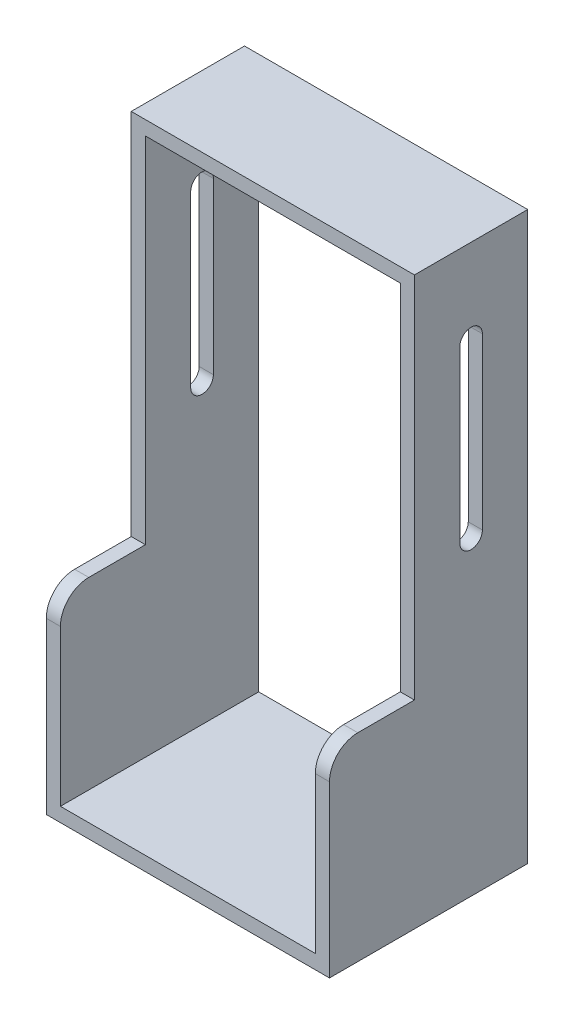
ISO-10303-21;
HEADER;
FILE_DESCRIPTION(('STEP AP214'),'2;1');
FILE_NAME('part.step','',(''),(''),'','','');
FILE_SCHEMA(('AUTOMOTIVE_DESIGN { 1 0 10303 214 1 1 1 1 }'));
ENDSEC;
DATA;
#1=APPLICATION_CONTEXT('core data for automotive mechanical design processes');
#2=APPLICATION_PROTOCOL_DEFINITION('international standard','automotive_design',2000,#1);
#3=PRODUCT_CONTEXT('',#1,'mechanical');
#4=PRODUCT('Part','Part','',(#3));
#5=PRODUCT_RELATED_PRODUCT_CATEGORY('part','',(#4));
#6=PRODUCT_DEFINITION_FORMATION('','',#4);
#7=PRODUCT_DEFINITION_CONTEXT('part definition',#1,'design');
#8=PRODUCT_DEFINITION('design','',#6,#7);
#9=PRODUCT_DEFINITION_SHAPE('','',#8);
#10=(LENGTH_UNIT() NAMED_UNIT(*) SI_UNIT(.MILLI.,.METRE.));
#11=(NAMED_UNIT(*) PLANE_ANGLE_UNIT() SI_UNIT($,.RADIAN.));
#12=(NAMED_UNIT(*) SI_UNIT($,.STERADIAN.) SOLID_ANGLE_UNIT());
#13=UNCERTAINTY_MEASURE_WITH_UNIT(LENGTH_MEASURE(1.E-05),#10,'distance_accuracy_value','');
#14=(GEOMETRIC_REPRESENTATION_CONTEXT(3) GLOBAL_UNCERTAINTY_ASSIGNED_CONTEXT((#13)) GLOBAL_UNIT_ASSIGNED_CONTEXT((#10,
#11,#12)) REPRESENTATION_CONTEXT('',''));
#15=CARTESIAN_POINT('',(0.,0.,0.));
#16=DIRECTION('',(0.,0.,1.));
#17=DIRECTION('',(1.,0.,0.));
#18=AXIS2_PLACEMENT_3D('',#15,#16,#17);
#19=CARTESIAN_POINT('',(0.,0.,70.));
#20=DIRECTION('',(0.,0.,-1.));
#21=DIRECTION('',(-1.,0.,0.));
#22=AXIS2_PLACEMENT_3D('',#19,#20,#21);
#23=PLANE('',#22);
#24=DIRECTION('',(0.,1.,0.));
#25=VECTOR('',#24,1.);
#26=CARTESIAN_POINT('',(50.,-100.,70.));
#27=LINE('',#26,#25);
#28=CARTESIAN_POINT('',(50.,-100.,70.));
#29=VERTEX_POINT('',#28);
#30=CARTESIAN_POINT('',(50.,-40.,70.));
#31=VERTEX_POINT('',#30);
#32=EDGE_CURVE('E300',#29,#31,#27,.T.);
#33=ORIENTED_EDGE('',*,*,#32,.T.);
#34=DIRECTION('',(1.,0.,0.));
#35=VECTOR('',#34,1.);
#36=CARTESIAN_POINT('',(0.,-40.,70.));
#37=LINE('',#36,#35);
#38=CARTESIAN_POINT('',(45.,-40.,70.));
#39=VERTEX_POINT('',#38);
#40=EDGE_CURVE('E337',#31,#39,#37,.F.);
#41=ORIENTED_EDGE('',*,*,#40,.T.);
#42=DIRECTION('',(0.,1.,0.));
#43=VECTOR('',#42,1.);
#44=CARTESIAN_POINT('',(45.,-95.,70.));
#45=LINE('',#44,#43);
#46=CARTESIAN_POINT('',(45.,-95.,70.));
#47=VERTEX_POINT('',#46);
#48=EDGE_CURVE('E272',#47,#39,#45,.T.);
#49=ORIENTED_EDGE('',*,*,#48,.F.);
#50=DIRECTION('',(1.,0.,0.));
#51=VECTOR('',#50,1.);
#52=CARTESIAN_POINT('',(-45.,-95.,70.));
#53=LINE('',#52,#51);
#54=CARTESIAN_POINT('',(-45.,-95.,70.));
#55=VERTEX_POINT('',#54);
#56=EDGE_CURVE('E278',#55,#47,#53,.T.);
#57=ORIENTED_EDGE('',*,*,#56,.F.);
#58=DIRECTION('',(0.,-1.,0.));
#59=VECTOR('',#58,1.);
#60=CARTESIAN_POINT('',(-45.,-95.,70.));
#61=LINE('',#60,#59);
#62=CARTESIAN_POINT('',(-45.,-40.,70.));
#63=VERTEX_POINT('',#62);
#64=EDGE_CURVE('E275',#63,#55,#61,.T.);
#65=ORIENTED_EDGE('',*,*,#64,.F.);
#66=DIRECTION('',(1.,0.,0.));
#67=VECTOR('',#66,1.);
#68=CARTESIAN_POINT('',(0.,-40.,70.));
#69=LINE('',#68,#67);
#70=CARTESIAN_POINT('',(-50.,-40.,70.));
#71=VERTEX_POINT('',#70);
#72=EDGE_CURVE('E335',#63,#71,#69,.F.);
#73=ORIENTED_EDGE('',*,*,#72,.T.);
#74=DIRECTION('',(0.,-1.,0.));
#75=VECTOR('',#74,1.);
#76=CARTESIAN_POINT('',(-50.,-100.,70.));
#77=LINE('',#76,#75);
#78=CARTESIAN_POINT('',(-50.,-100.,70.));
#79=VERTEX_POINT('',#78);
#80=EDGE_CURVE('E303',#71,#79,#77,.T.);
#81=ORIENTED_EDGE('',*,*,#80,.T.);
#82=DIRECTION('',(1.,0.,0.));
#83=VECTOR('',#82,1.);
#84=CARTESIAN_POINT('',(-50.,-100.,70.));
#85=LINE('',#84,#83);
#86=EDGE_CURVE('E306',#79,#29,#85,.T.);
#87=ORIENTED_EDGE('',*,*,#86,.T.);
#88=EDGE_LOOP('',(#33,#41,#49,#57,#65,#73,#81,#87));
#89=FACE_BOUND('',#88,.T.);
#90=ADVANCED_FACE('F37',(#89),#23,.F.);
#91=CARTESIAN_POINT('',(0.,0.,0.));
#92=DIRECTION('',(0.,0.,-1.));
#93=DIRECTION('',(-1.,0.,0.));
#94=AXIS2_PLACEMENT_3D('',#91,#92,#93);
#95=PLANE('',#94);
#96=DIRECTION('',(0.,1.,0.));
#97=VECTOR('',#96,1.);
#98=CARTESIAN_POINT('',(50.,-100.,0.));
#99=LINE('',#98,#97);
#100=CARTESIAN_POINT('',(50.,-100.,0.));
#101=VERTEX_POINT('',#100);
#102=CARTESIAN_POINT('',(50.,100.,0.));
#103=VERTEX_POINT('',#102);
#104=EDGE_CURVE('E299',#101,#103,#99,.T.);
#105=ORIENTED_EDGE('',*,*,#104,.F.);
#106=DIRECTION('',(1.,0.,0.));
#107=VECTOR('',#106,1.);
#108=CARTESIAN_POINT('',(-50.,-100.,0.));
#109=LINE('',#108,#107);
#110=CARTESIAN_POINT('',(-50.,-100.,0.));
#111=VERTEX_POINT('',#110);
#112=EDGE_CURVE('E304',#111,#101,#109,.T.);
#113=ORIENTED_EDGE('',*,*,#112,.F.);
#114=DIRECTION('',(0.,-1.,0.));
#115=VECTOR('',#114,1.);
#116=CARTESIAN_POINT('',(-50.,-100.,0.));
#117=LINE('',#116,#115);
#118=CARTESIAN_POINT('',(-50.,100.,0.));
#119=VERTEX_POINT('',#118);
#120=EDGE_CURVE('E314',#119,#111,#117,.T.);
#121=ORIENTED_EDGE('',*,*,#120,.F.);
#122=DIRECTION('',(-1.,0.,0.));
#123=VECTOR('',#122,1.);
#124=CARTESIAN_POINT('',(-50.,100.,0.));
#125=LINE('',#124,#123);
#126=EDGE_CURVE('E311',#103,#119,#125,.T.);
#127=ORIENTED_EDGE('',*,*,#126,.F.);
#128=EDGE_LOOP('',(#105,#113,#121,#127));
#129=FACE_BOUND('',#128,.T.);
#130=DIRECTION('',(1.,0.,0.));
#131=VECTOR('',#130,1.);
#132=CARTESIAN_POINT('',(-45.,-95.,0.));
#133=LINE('',#132,#131);
#134=CARTESIAN_POINT('',(-45.,-95.,0.));
#135=VERTEX_POINT('',#134);
#136=CARTESIAN_POINT('',(45.,-95.,0.));
#137=VERTEX_POINT('',#136);
#138=EDGE_CURVE('E276',#135,#137,#133,.T.);
#139=ORIENTED_EDGE('',*,*,#138,.T.);
#140=DIRECTION('',(0.,1.,0.));
#141=VECTOR('',#140,1.);
#142=CARTESIAN_POINT('',(45.,-95.,0.));
#143=LINE('',#142,#141);
#144=CARTESIAN_POINT('',(45.,95.,0.));
#145=VERTEX_POINT('',#144);
#146=EDGE_CURVE('E271',#137,#145,#143,.T.);
#147=ORIENTED_EDGE('',*,*,#146,.T.);
#148=DIRECTION('',(-1.,0.,0.));
#149=VECTOR('',#148,1.);
#150=CARTESIAN_POINT('',(-45.,95.,0.));
#151=LINE('',#150,#149);
#152=CARTESIAN_POINT('',(-45.,95.,0.));
#153=VERTEX_POINT('',#152);
#154=EDGE_CURVE('E283',#145,#153,#151,.T.);
#155=ORIENTED_EDGE('',*,*,#154,.T.);
#156=DIRECTION('',(0.,-1.,0.));
#157=VECTOR('',#156,1.);
#158=CARTESIAN_POINT('',(-45.,-95.,0.));
#159=LINE('',#158,#157);
#160=EDGE_CURVE('E286',#153,#135,#159,.T.);
#161=ORIENTED_EDGE('',*,*,#160,.T.);
#162=EDGE_LOOP('',(#139,#147,#155,#161));
#163=FACE_BOUND('',#162,.T.);
#164=ADVANCED_FACE('F424',(#129,#163),#95,.T.);
#165=CARTESIAN_POINT('',(50.,-100.,70.));
#166=DIRECTION('',(-1.,0.,0.));
#167=DIRECTION('',(0.,0.,1.));
#168=AXIS2_PLACEMENT_3D('',#165,#166,#167);
#169=PLANE('',#168);
#170=DIRECTION('',(0.,-1.,0.));
#171=VECTOR('',#170,1.);
#172=CARTESIAN_POINT('',(50.,10.,16.));
#173=LINE('',#172,#171);
#174=CARTESIAN_POINT('',(50.,70.,16.));
#175=VERTEX_POINT('',#174);
#176=CARTESIAN_POINT('',(50.,10.,16.));
#177=VERTEX_POINT('',#176);
#178=EDGE_CURVE('E210',#175,#177,#173,.T.);
#179=ORIENTED_EDGE('',*,*,#178,.T.);
#180=CARTESIAN_POINT('',(50.,10.,20.));
#181=DIRECTION('',(-1.,0.,0.));
#182=DIRECTION('',(0.,0.,1.));
#183=AXIS2_PLACEMENT_3D('',#180,#181,#182);
#184=CIRCLE('',#183,4.);
#185=CARTESIAN_POINT('',(50.,10.,24.));
#186=VERTEX_POINT('',#185);
#187=EDGE_CURVE('E192',#177,#186,#184,.T.);
#188=ORIENTED_EDGE('',*,*,#187,.T.);
#189=DIRECTION('',(0.,1.,0.));
#190=VECTOR('',#189,1.);
#191=CARTESIAN_POINT('',(50.,10.,24.));
#192=LINE('',#191,#190);
#193=CARTESIAN_POINT('',(50.,70.,24.));
#194=VERTEX_POINT('',#193);
#195=EDGE_CURVE('E202',#186,#194,#192,.T.);
#196=ORIENTED_EDGE('',*,*,#195,.T.);
#197=CARTESIAN_POINT('',(50.,70.,20.));
#198=DIRECTION('',(-1.,0.,0.));
#199=DIRECTION('',(0.,0.,1.));
#200=AXIS2_PLACEMENT_3D('',#197,#198,#199);
#201=CIRCLE('',#200,4.);
#202=EDGE_CURVE('E52',#194,#175,#201,.T.);
#203=ORIENTED_EDGE('',*,*,#202,.T.);
#204=EDGE_LOOP('',(#179,#188,#196,#203));
#205=FACE_BOUND('',#204,.T.);
#206=DIRECTION('',(0.,0.,1.));
#207=VECTOR('',#206,1.);
#208=CARTESIAN_POINT('',(50.,-30.,70.));
#209=LINE('',#208,#207);
#210=CARTESIAN_POINT('',(50.,-30.,40.));
#211=VERTEX_POINT('',#210);
#212=CARTESIAN_POINT('',(50.,-30.,60.));
#213=VERTEX_POINT('',#212);
#214=EDGE_CURVE('E261',#211,#213,#209,.T.);
#215=ORIENTED_EDGE('',*,*,#214,.T.);
#216=CARTESIAN_POINT('',(50.,-40.,60.));
#217=DIRECTION('',(-1.,0.,0.));
#218=DIRECTION('',(0.,0.,1.));
#219=AXIS2_PLACEMENT_3D('',#216,#217,#218);
#220=CIRCLE('',#219,10.);
#221=EDGE_CURVE('E333',#213,#31,#220,.F.);
#222=ORIENTED_EDGE('',*,*,#221,.T.);
#223=ORIENTED_EDGE('',*,*,#32,.F.);
#224=DIRECTION('',(0.,0.,-1.));
#225=VECTOR('',#224,1.);
#226=CARTESIAN_POINT('',(50.,-100.,70.));
#227=LINE('',#226,#225);
#228=EDGE_CURVE('E308',#29,#101,#227,.T.);
#229=ORIENTED_EDGE('',*,*,#228,.T.);
#230=ORIENTED_EDGE('',*,*,#104,.T.);
#231=DIRECTION('',(0.,0.,-1.));
#232=VECTOR('',#231,1.);
#233=CARTESIAN_POINT('',(50.,100.,70.));
#234=LINE('',#233,#232);
#235=CARTESIAN_POINT('',(50.,100.,40.));
#236=VERTEX_POINT('',#235);
#237=EDGE_CURVE('E324',#236,#103,#234,.T.);
#238=ORIENTED_EDGE('',*,*,#237,.F.);
#239=DIRECTION('',(0.,-1.,0.));
#240=VECTOR('',#239,1.);
#241=CARTESIAN_POINT('',(50.,-100.,40.));
#242=LINE('',#241,#240);
#243=EDGE_CURVE('E268',#236,#211,#242,.T.);
#244=ORIENTED_EDGE('',*,*,#243,.T.);
#245=EDGE_LOOP('',(#215,#222,#223,#229,#230,#238,#244));
#246=FACE_BOUND('',#245,.T.);
#247=ADVANCED_FACE('F207',(#205,#246),#169,.F.);
#248=CARTESIAN_POINT('',(-50.,100.,70.));
#249=DIRECTION('',(0.,-1.,0.));
#250=DIRECTION('',(0.,0.,-1.));
#251=AXIS2_PLACEMENT_3D('',#248,#249,#250);
#252=PLANE('',#251);
#253=DIRECTION('',(0.,0.,-1.));
#254=VECTOR('',#253,1.);
#255=CARTESIAN_POINT('',(-50.,100.,70.));
#256=LINE('',#255,#254);
#257=CARTESIAN_POINT('',(-50.,100.,40.));
#258=VERTEX_POINT('',#257);
#259=EDGE_CURVE('E322',#258,#119,#256,.T.);
#260=ORIENTED_EDGE('',*,*,#259,.F.);
#261=DIRECTION('',(1.,0.,0.));
#262=VECTOR('',#261,1.);
#263=CARTESIAN_POINT('',(-50.,100.,40.));
#264=LINE('',#263,#262);
#265=EDGE_CURVE('E252',#258,#236,#264,.T.);
#266=ORIENTED_EDGE('',*,*,#265,.T.);
#267=ORIENTED_EDGE('',*,*,#237,.T.);
#268=ORIENTED_EDGE('',*,*,#126,.T.);
#269=EDGE_LOOP('',(#260,#266,#267,#268));
#270=FACE_BOUND('',#269,.T.);
#271=ADVANCED_FACE('F376',(#270),#252,.F.);
#272=CARTESIAN_POINT('',(-50.,-100.,70.));
#273=DIRECTION('',(1.,0.,0.));
#274=DIRECTION('',(0.,0.,-1.));
#275=AXIS2_PLACEMENT_3D('',#272,#273,#274);
#276=PLANE('',#275);
#277=DIRECTION('',(0.,1.,0.));
#278=VECTOR('',#277,1.);
#279=CARTESIAN_POINT('',(-50.,10.,24.));
#280=LINE('',#279,#278);
#281=CARTESIAN_POINT('',(-50.,10.,24.));
#282=VERTEX_POINT('',#281);
#283=CARTESIAN_POINT('',(-50.,70.,24.));
#284=VERTEX_POINT('',#283);
#285=EDGE_CURVE('E220',#282,#284,#280,.T.);
#286=ORIENTED_EDGE('',*,*,#285,.F.);
#287=CARTESIAN_POINT('',(-50.,10.,20.));
#288=DIRECTION('',(-1.,0.,0.));
#289=DIRECTION('',(0.,0.,1.));
#290=AXIS2_PLACEMENT_3D('',#287,#288,#289);
#291=CIRCLE('',#290,4.);
#292=CARTESIAN_POINT('',(-50.,10.,16.));
#293=VERTEX_POINT('',#292);
#294=EDGE_CURVE('E60',#293,#282,#291,.T.);
#295=ORIENTED_EDGE('',*,*,#294,.F.);
#296=DIRECTION('',(0.,-1.,0.));
#297=VECTOR('',#296,1.);
#298=CARTESIAN_POINT('',(-50.,10.,16.));
#299=LINE('',#298,#297);
#300=CARTESIAN_POINT('',(-50.,70.,16.));
#301=VERTEX_POINT('',#300);
#302=EDGE_CURVE('E211',#301,#293,#299,.T.);
#303=ORIENTED_EDGE('',*,*,#302,.F.);
#304=CARTESIAN_POINT('',(-50.,70.,20.));
#305=DIRECTION('',(-1.,0.,0.));
#306=DIRECTION('',(0.,0.,1.));
#307=AXIS2_PLACEMENT_3D('',#304,#305,#306);
#308=CIRCLE('',#307,4.);
#309=EDGE_CURVE('E214',#284,#301,#308,.T.);
#310=ORIENTED_EDGE('',*,*,#309,.F.);
#311=EDGE_LOOP('',(#286,#295,#303,#310));
#312=FACE_BOUND('',#311,.T.);
#313=ORIENTED_EDGE('',*,*,#80,.F.);
#314=CARTESIAN_POINT('',(-50.,-40.,60.));
#315=DIRECTION('',(1.,0.,0.));
#316=DIRECTION('',(0.,0.,-1.));
#317=AXIS2_PLACEMENT_3D('',#314,#315,#316);
#318=CIRCLE('',#317,10.);
#319=CARTESIAN_POINT('',(-50.,-30.,60.));
#320=VERTEX_POINT('',#319);
#321=EDGE_CURVE('E346',#71,#320,#318,.F.);
#322=ORIENTED_EDGE('',*,*,#321,.T.);
#323=DIRECTION('',(0.,0.,-1.));
#324=VECTOR('',#323,1.);
#325=CARTESIAN_POINT('',(-50.,-30.,70.));
#326=LINE('',#325,#324);
#327=CARTESIAN_POINT('',(-50.,-30.,40.));
#328=VERTEX_POINT('',#327);
#329=EDGE_CURVE('E244',#320,#328,#326,.T.);
#330=ORIENTED_EDGE('',*,*,#329,.T.);
#331=DIRECTION('',(0.,1.,0.));
#332=VECTOR('',#331,1.);
#333=CARTESIAN_POINT('',(-50.,100.,40.));
#334=LINE('',#333,#332);
#335=EDGE_CURVE('E248',#328,#258,#334,.T.);
#336=ORIENTED_EDGE('',*,*,#335,.T.);
#337=ORIENTED_EDGE('',*,*,#259,.T.);
#338=ORIENTED_EDGE('',*,*,#120,.T.);
#339=DIRECTION('',(0.,0.,-1.));
#340=VECTOR('',#339,1.);
#341=CARTESIAN_POINT('',(-50.,-100.,70.));
#342=LINE('',#341,#340);
#343=EDGE_CURVE('E319',#79,#111,#342,.T.);
#344=ORIENTED_EDGE('',*,*,#343,.F.);
#345=EDGE_LOOP('',(#313,#322,#330,#336,#337,#338,#344));
#346=FACE_BOUND('',#345,.T.);
#347=ADVANCED_FACE('F372',(#312,#346),#276,.F.);
#348=CARTESIAN_POINT('',(-50.,-100.,70.));
#349=DIRECTION('',(0.,1.,0.));
#350=DIRECTION('',(0.,0.,1.));
#351=AXIS2_PLACEMENT_3D('',#348,#349,#350);
#352=PLANE('',#351);
#353=ORIENTED_EDGE('',*,*,#112,.T.);
#354=ORIENTED_EDGE('',*,*,#228,.F.);
#355=ORIENTED_EDGE('',*,*,#86,.F.);
#356=ORIENTED_EDGE('',*,*,#343,.T.);
#357=EDGE_LOOP('',(#353,#354,#355,#356));
#358=FACE_BOUND('',#357,.T.);
#359=ADVANCED_FACE('F375',(#358),#352,.F.);
#360=CARTESIAN_POINT('',(45.,-95.,70.));
#361=DIRECTION('',(-1.,0.,0.));
#362=DIRECTION('',(0.,0.,1.));
#363=AXIS2_PLACEMENT_3D('',#360,#361,#362);
#364=PLANE('',#363);
#365=CARTESIAN_POINT('',(45.,10.,20.));
#366=DIRECTION('',(-1.,0.,0.));
#367=DIRECTION('',(0.,0.,1.));
#368=AXIS2_PLACEMENT_3D('',#365,#366,#367);
#369=CIRCLE('',#368,4.);
#370=CARTESIAN_POINT('',(45.,10.,16.));
#371=VERTEX_POINT('',#370);
#372=CARTESIAN_POINT('',(45.,10.,24.));
#373=VERTEX_POINT('',#372);
#374=EDGE_CURVE('E195',#371,#373,#369,.T.);
#375=ORIENTED_EDGE('',*,*,#374,.F.);
#376=DIRECTION('',(0.,-1.,0.));
#377=VECTOR('',#376,1.);
#378=CARTESIAN_POINT('',(45.,-95.,16.));
#379=LINE('',#378,#377);
#380=CARTESIAN_POINT('',(45.,70.,16.));
#381=VERTEX_POINT('',#380);
#382=EDGE_CURVE('E237',#381,#371,#379,.T.);
#383=ORIENTED_EDGE('',*,*,#382,.F.);
#384=CARTESIAN_POINT('',(45.,70.,20.));
#385=DIRECTION('',(-1.,0.,0.));
#386=DIRECTION('',(0.,0.,1.));
#387=AXIS2_PLACEMENT_3D('',#384,#385,#386);
#388=CIRCLE('',#387,4.);
#389=CARTESIAN_POINT('',(45.,70.,24.));
#390=VERTEX_POINT('',#389);
#391=EDGE_CURVE('E235',#390,#381,#388,.T.);
#392=ORIENTED_EDGE('',*,*,#391,.F.);
#393=DIRECTION('',(0.,1.,0.));
#394=VECTOR('',#393,1.);
#395=CARTESIAN_POINT('',(45.,-95.,24.));
#396=LINE('',#395,#394);
#397=EDGE_CURVE('E227',#373,#390,#396,.T.);
#398=ORIENTED_EDGE('',*,*,#397,.F.);
#399=EDGE_LOOP('',(#375,#383,#392,#398));
#400=FACE_BOUND('',#399,.T.);
#401=ORIENTED_EDGE('',*,*,#48,.T.);
#402=CARTESIAN_POINT('',(45.,-40.,60.));
#403=DIRECTION('',(-1.,0.,0.));
#404=DIRECTION('',(0.,0.,1.));
#405=AXIS2_PLACEMENT_3D('',#402,#403,#404);
#406=CIRCLE('',#405,10.);
#407=CARTESIAN_POINT('',(45.,-30.,60.));
#408=VERTEX_POINT('',#407);
#409=EDGE_CURVE('E339',#39,#408,#406,.T.);
#410=ORIENTED_EDGE('',*,*,#409,.T.);
#411=DIRECTION('',(0.,0.,1.));
#412=VECTOR('',#411,1.);
#413=CARTESIAN_POINT('',(45.,-30.,70.));
#414=LINE('',#413,#412);
#415=CARTESIAN_POINT('',(45.,-30.,40.));
#416=VERTEX_POINT('',#415);
#417=EDGE_CURVE('E255',#416,#408,#414,.T.);
#418=ORIENTED_EDGE('',*,*,#417,.F.);
#419=DIRECTION('',(0.,-1.,0.));
#420=VECTOR('',#419,1.);
#421=CARTESIAN_POINT('',(45.,-95.,40.));
#422=LINE('',#421,#420);
#423=CARTESIAN_POINT('',(45.,95.,40.));
#424=VERTEX_POINT('',#423);
#425=EDGE_CURVE('E266',#424,#416,#422,.T.);
#426=ORIENTED_EDGE('',*,*,#425,.F.);
#427=DIRECTION('',(0.,0.,-1.));
#428=VECTOR('',#427,1.);
#429=CARTESIAN_POINT('',(45.,95.,70.));
#430=LINE('',#429,#428);
#431=EDGE_CURVE('E297',#424,#145,#430,.T.);
#432=ORIENTED_EDGE('',*,*,#431,.T.);
#433=ORIENTED_EDGE('',*,*,#146,.F.);
#434=DIRECTION('',(0.,0.,-1.));
#435=VECTOR('',#434,1.);
#436=CARTESIAN_POINT('',(45.,-95.,70.));
#437=LINE('',#436,#435);
#438=EDGE_CURVE('E280',#47,#137,#437,.T.);
#439=ORIENTED_EDGE('',*,*,#438,.F.);
#440=EDGE_LOOP('',(#401,#410,#418,#426,#432,#433,#439));
#441=FACE_BOUND('',#440,.T.);
#442=ADVANCED_FACE('F405',(#400,#441),#364,.T.);
#443=CARTESIAN_POINT('',(-45.,95.,70.));
#444=DIRECTION('',(0.,-1.,0.));
#445=DIRECTION('',(0.,0.,-1.));
#446=AXIS2_PLACEMENT_3D('',#443,#444,#445);
#447=PLANE('',#446);
#448=CARTESIAN_POINT('',(0.,95.,15.));
#449=DIRECTION('',(0.,-1.,0.));
#450=DIRECTION('',(0.,0.,-1.));
#451=AXIS2_PLACEMENT_3D('',#448,#449,#450);
#452=CIRCLE('',#451,2.5);
#453=CARTESIAN_POINT('',(0.,95.,12.5));
#454=VERTEX_POINT('',#453);
#455=EDGE_CURVE('E240',#454,#454,#452,.T.);
#456=ORIENTED_EDGE('',*,*,#455,.F.);
#457=EDGE_LOOP('',(#456));
#458=FACE_BOUND('',#457,.T.);
#459=DIRECTION('',(1.,0.,0.));
#460=VECTOR('',#459,1.);
#461=CARTESIAN_POINT('',(-45.,95.,40.));
#462=LINE('',#461,#460);
#463=CARTESIAN_POINT('',(-45.,95.,40.));
#464=VERTEX_POINT('',#463);
#465=EDGE_CURVE('E264',#464,#424,#462,.T.);
#466=ORIENTED_EDGE('',*,*,#465,.F.);
#467=DIRECTION('',(0.,0.,-1.));
#468=VECTOR('',#467,1.);
#469=CARTESIAN_POINT('',(-45.,95.,70.));
#470=LINE('',#469,#468);
#471=EDGE_CURVE('E295',#464,#153,#470,.T.);
#472=ORIENTED_EDGE('',*,*,#471,.T.);
#473=ORIENTED_EDGE('',*,*,#154,.F.);
#474=ORIENTED_EDGE('',*,*,#431,.F.);
#475=EDGE_LOOP('',(#466,#472,#473,#474));
#476=FACE_BOUND('',#475,.T.);
#477=ADVANCED_FACE('F402',(#458,#476),#447,.T.);
#478=CARTESIAN_POINT('',(-45.,-95.,70.));
#479=DIRECTION('',(1.,0.,0.));
#480=DIRECTION('',(0.,0.,-1.));
#481=AXIS2_PLACEMENT_3D('',#478,#479,#480);
#482=PLANE('',#481);
#483=CARTESIAN_POINT('',(-45.,10.,20.));
#484=DIRECTION('',(1.,0.,0.));
#485=DIRECTION('',(0.,0.,-1.));
#486=AXIS2_PLACEMENT_3D('',#483,#484,#485);
#487=CIRCLE('',#486,4.);
#488=CARTESIAN_POINT('',(-45.,10.,24.));
#489=VERTEX_POINT('',#488);
#490=CARTESIAN_POINT('',(-45.,10.,16.));
#491=VERTEX_POINT('',#490);
#492=EDGE_CURVE('E11',#489,#491,#487,.T.);
#493=ORIENTED_EDGE('',*,*,#492,.F.);
#494=DIRECTION('',(0.,-1.,0.));
#495=VECTOR('',#494,1.);
#496=CARTESIAN_POINT('',(-45.,-95.,24.));
#497=LINE('',#496,#495);
#498=CARTESIAN_POINT('',(-45.,70.,24.));
#499=VERTEX_POINT('',#498);
#500=EDGE_CURVE('E348',#499,#489,#497,.T.);
#501=ORIENTED_EDGE('',*,*,#500,.F.);
#502=CARTESIAN_POINT('',(-45.,70.,20.));
#503=DIRECTION('',(1.,0.,0.));
#504=DIRECTION('',(0.,0.,-1.));
#505=AXIS2_PLACEMENT_3D('',#502,#503,#504);
#506=CIRCLE('',#505,4.);
#507=CARTESIAN_POINT('',(-45.,70.,16.));
#508=VERTEX_POINT('',#507);
#509=EDGE_CURVE('E350',#508,#499,#506,.T.);
#510=ORIENTED_EDGE('',*,*,#509,.F.);
#511=DIRECTION('',(0.,1.,0.));
#512=VECTOR('',#511,1.);
#513=CARTESIAN_POINT('',(-45.,-95.,16.));
#514=LINE('',#513,#512);
#515=EDGE_CURVE('E45',#491,#508,#514,.T.);
#516=ORIENTED_EDGE('',*,*,#515,.F.);
#517=EDGE_LOOP('',(#493,#501,#510,#516));
#518=FACE_BOUND('',#517,.T.);
#519=DIRECTION('',(0.,0.,-1.));
#520=VECTOR('',#519,1.);
#521=CARTESIAN_POINT('',(-45.,-30.,70.));
#522=LINE('',#521,#520);
#523=CARTESIAN_POINT('',(-45.,-30.,60.));
#524=VERTEX_POINT('',#523);
#525=CARTESIAN_POINT('',(-45.,-30.,40.));
#526=VERTEX_POINT('',#525);
#527=EDGE_CURVE('E326',#524,#526,#522,.T.);
#528=ORIENTED_EDGE('',*,*,#527,.F.);
#529=CARTESIAN_POINT('',(-45.,-40.,60.));
#530=DIRECTION('',(1.,0.,0.));
#531=DIRECTION('',(0.,0.,-1.));
#532=AXIS2_PLACEMENT_3D('',#529,#530,#531);
#533=CIRCLE('',#532,10.);
#534=EDGE_CURVE('E344',#524,#63,#533,.T.);
#535=ORIENTED_EDGE('',*,*,#534,.T.);
#536=ORIENTED_EDGE('',*,*,#64,.T.);
#537=DIRECTION('',(0.,0.,-1.));
#538=VECTOR('',#537,1.);
#539=CARTESIAN_POINT('',(-45.,-95.,70.));
#540=LINE('',#539,#538);
#541=EDGE_CURVE('E293',#55,#135,#540,.T.);
#542=ORIENTED_EDGE('',*,*,#541,.T.);
#543=ORIENTED_EDGE('',*,*,#160,.F.);
#544=ORIENTED_EDGE('',*,*,#471,.F.);
#545=DIRECTION('',(0.,1.,0.));
#546=VECTOR('',#545,1.);
#547=CARTESIAN_POINT('',(-45.,-95.,40.));
#548=LINE('',#547,#546);
#549=EDGE_CURVE('E328',#526,#464,#548,.T.);
#550=ORIENTED_EDGE('',*,*,#549,.F.);
#551=EDGE_LOOP('',(#528,#535,#536,#542,#543,#544,#550));
#552=FACE_BOUND('',#551,.T.);
#553=ADVANCED_FACE('F365',(#518,#552),#482,.T.);
#554=CARTESIAN_POINT('',(-45.,-95.,70.));
#555=DIRECTION('',(0.,1.,0.));
#556=DIRECTION('',(0.,0.,1.));
#557=AXIS2_PLACEMENT_3D('',#554,#555,#556);
#558=PLANE('',#557);
#559=ORIENTED_EDGE('',*,*,#138,.F.);
#560=ORIENTED_EDGE('',*,*,#541,.F.);
#561=ORIENTED_EDGE('',*,*,#56,.T.);
#562=ORIENTED_EDGE('',*,*,#438,.T.);
#563=EDGE_LOOP('',(#559,#560,#561,#562));
#564=FACE_BOUND('',#563,.T.);
#565=ADVANCED_FACE('F435',(#564),#558,.T.);
#566=CARTESIAN_POINT('',(-50.,100.,40.));
#567=DIRECTION('',(0.,0.,-1.));
#568=DIRECTION('',(0.,1.,0.));
#569=AXIS2_PLACEMENT_3D('',#566,#567,#568);
#570=PLANE('',#569);
#571=ORIENTED_EDGE('',*,*,#265,.F.);
#572=ORIENTED_EDGE('',*,*,#335,.F.);
#573=DIRECTION('',(1.,0.,0.));
#574=VECTOR('',#573,1.);
#575=CARTESIAN_POINT('',(-50.,-30.,40.));
#576=LINE('',#575,#574);
#577=EDGE_CURVE('E256',#328,#526,#576,.T.);
#578=ORIENTED_EDGE('',*,*,#577,.T.);
#579=ORIENTED_EDGE('',*,*,#549,.T.);
#580=ORIENTED_EDGE('',*,*,#465,.T.);
#581=ORIENTED_EDGE('',*,*,#425,.T.);
#582=EDGE_CURVE('E251',#416,#211,#576,.T.);
#583=ORIENTED_EDGE('',*,*,#582,.T.);
#584=ORIENTED_EDGE('',*,*,#243,.F.);
#585=EDGE_LOOP('',(#571,#572,#578,#579,#580,#581,#583,#584));
#586=FACE_BOUND('',#585,.T.);
#587=ADVANCED_FACE('F397',(#586),#570,.F.);
#588=CARTESIAN_POINT('',(-50.,-30.,70.));
#589=DIRECTION('',(0.,-1.,0.));
#590=DIRECTION('',(0.,0.,-1.));
#591=AXIS2_PLACEMENT_3D('',#588,#589,#590);
#592=PLANE('',#591);
#593=ORIENTED_EDGE('',*,*,#417,.T.);
#594=DIRECTION('',(1.,0.,0.));
#595=VECTOR('',#594,1.);
#596=CARTESIAN_POINT('',(-50.,-30.,60.));
#597=LINE('',#596,#595);
#598=EDGE_CURVE('E330',#408,#213,#597,.T.);
#599=ORIENTED_EDGE('',*,*,#598,.T.);
#600=ORIENTED_EDGE('',*,*,#214,.F.);
#601=ORIENTED_EDGE('',*,*,#582,.F.);
#602=EDGE_LOOP('',(#593,#599,#600,#601));
#603=FACE_BOUND('',#602,.T.);
#604=ADVANCED_FACE('F411',(#603),#592,.F.);
#605=ORIENTED_EDGE('',*,*,#329,.F.);
#606=DIRECTION('',(1.,0.,0.));
#607=VECTOR('',#606,1.);
#608=CARTESIAN_POINT('',(-50.,-30.,60.));
#609=LINE('',#608,#607);
#610=EDGE_CURVE('E341',#320,#524,#609,.T.);
#611=ORIENTED_EDGE('',*,*,#610,.T.);
#612=ORIENTED_EDGE('',*,*,#527,.T.);
#613=ORIENTED_EDGE('',*,*,#577,.F.);
#614=EDGE_LOOP('',(#605,#611,#612,#613));
#615=FACE_BOUND('',#614,.T.);
#616=ADVANCED_FACE('F389',(#615),#592,.F.);
#617=CARTESIAN_POINT('',(-50.,-40.,60.));
#618=DIRECTION('',(1.,0.,0.));
#619=DIRECTION('',(0.,0.,-1.));
#620=AXIS2_PLACEMENT_3D('',#617,#618,#619);
#621=CYLINDRICAL_SURFACE('',#620,10.);
#622=ORIENTED_EDGE('',*,*,#409,.F.);
#623=ORIENTED_EDGE('',*,*,#40,.F.);
#624=ORIENTED_EDGE('',*,*,#221,.F.);
#625=ORIENTED_EDGE('',*,*,#598,.F.);
#626=EDGE_LOOP('',(#622,#623,#624,#625));
#627=FACE_BOUND('',#626,.T.);
#628=ADVANCED_FACE('F430',(#627),#621,.T.);
#629=CARTESIAN_POINT('',(-50.,-40.,60.));
#630=DIRECTION('',(1.,0.,0.));
#631=DIRECTION('',(0.,0.,-1.));
#632=AXIS2_PLACEMENT_3D('',#629,#630,#631);
#633=CYLINDRICAL_SURFACE('',#632,10.);
#634=ORIENTED_EDGE('',*,*,#321,.F.);
#635=ORIENTED_EDGE('',*,*,#72,.F.);
#636=ORIENTED_EDGE('',*,*,#534,.F.);
#637=ORIENTED_EDGE('',*,*,#610,.F.);
#638=EDGE_LOOP('',(#634,#635,#636,#637));
#639=FACE_BOUND('',#638,.T.);
#640=ADVANCED_FACE('F39',(#639),#633,.T.);
#641=CARTESIAN_POINT('',(0.,90.,15.));
#642=DIRECTION('',(0.,1.,0.));
#643=DIRECTION('',(0.,0.,1.));
#644=AXIS2_PLACEMENT_3D('',#641,#642,#643);
#645=CYLINDRICAL_SURFACE('',#644,2.5);
#646=CARTESIAN_POINT('',(0.,90.,15.));
#647=DIRECTION('',(0.,-1.,0.));
#648=DIRECTION('',(0.,0.,-1.));
#649=AXIS2_PLACEMENT_3D('',#646,#647,#648);
#650=CIRCLE('',#649,2.5);
#651=CARTESIAN_POINT('',(0.,90.,12.5));
#652=VERTEX_POINT('',#651);
#653=EDGE_CURVE('E241',#652,#652,#650,.T.);
#654=ORIENTED_EDGE('',*,*,#653,.F.);
#655=EDGE_LOOP('',(#654));
#656=FACE_BOUND('',#655,.T.);
#657=ORIENTED_EDGE('',*,*,#455,.T.);
#658=EDGE_LOOP('',(#657));
#659=FACE_BOUND('',#658,.T.);
#660=ADVANCED_FACE('F454',(#656,#659),#645,.T.);
#661=CARTESIAN_POINT('',(0.,90.,15.));
#662=DIRECTION('',(0.,-1.,0.));
#663=DIRECTION('',(0.,0.,-1.));
#664=AXIS2_PLACEMENT_3D('',#661,#662,#663);
#665=PLANE('',#664);
#666=ORIENTED_EDGE('',*,*,#653,.T.);
#667=EDGE_LOOP('',(#666));
#668=FACE_BOUND('',#667,.T.);
#669=ADVANCED_FACE('F493',(#668),#665,.T.);
#670=CARTESIAN_POINT('',(50.,10.,24.));
#671=DIRECTION('',(0.,0.,1.));
#672=DIRECTION('',(0.,-1.,0.));
#673=AXIS2_PLACEMENT_3D('',#670,#671,#672);
#674=PLANE('',#673);
#675=ORIENTED_EDGE('',*,*,#500,.T.);
#676=DIRECTION('',(-1.,0.,0.));
#677=VECTOR('',#676,1.);
#678=CARTESIAN_POINT('',(50.,10.,24.));
#679=LINE('',#678,#677);
#680=EDGE_CURVE('E199',#489,#282,#679,.T.);
#681=ORIENTED_EDGE('',*,*,#680,.T.);
#682=ORIENTED_EDGE('',*,*,#285,.T.);
#683=DIRECTION('',(-1.,0.,0.));
#684=VECTOR('',#683,1.);
#685=CARTESIAN_POINT('',(50.,70.,24.));
#686=LINE('',#685,#684);
#687=EDGE_CURVE('E198',#499,#284,#686,.T.);
#688=ORIENTED_EDGE('',*,*,#687,.F.);
#689=EDGE_LOOP('',(#675,#681,#682,#688));
#690=FACE_BOUND('',#689,.T.);
#691=ADVANCED_FACE('F368',(#690),#674,.F.);
#692=CARTESIAN_POINT('',(50.,70.,20.));
#693=DIRECTION('',(-1.,0.,0.));
#694=DIRECTION('',(0.,0.,1.));
#695=AXIS2_PLACEMENT_3D('',#692,#693,#694);
#696=CYLINDRICAL_SURFACE('',#695,4.);
#697=ORIENTED_EDGE('',*,*,#509,.T.);
#698=ORIENTED_EDGE('',*,*,#687,.T.);
#699=ORIENTED_EDGE('',*,*,#309,.T.);
#700=DIRECTION('',(-1.,0.,0.));
#701=VECTOR('',#700,1.);
#702=CARTESIAN_POINT('',(50.,70.,16.));
#703=LINE('',#702,#701);
#704=EDGE_CURVE('E232',#508,#301,#703,.T.);
#705=ORIENTED_EDGE('',*,*,#704,.F.);
#706=EDGE_LOOP('',(#697,#698,#699,#705));
#707=FACE_BOUND('',#706,.T.);
#708=ADVANCED_FACE('F361',(#707),#696,.F.);
#709=CARTESIAN_POINT('',(50.,10.,16.));
#710=DIRECTION('',(0.,0.,-1.));
#711=DIRECTION('',(0.,1.,0.));
#712=AXIS2_PLACEMENT_3D('',#709,#710,#711);
#713=PLANE('',#712);
#714=ORIENTED_EDGE('',*,*,#515,.T.);
#715=ORIENTED_EDGE('',*,*,#704,.T.);
#716=ORIENTED_EDGE('',*,*,#302,.T.);
#717=DIRECTION('',(-1.,0.,0.));
#718=VECTOR('',#717,1.);
#719=CARTESIAN_POINT('',(50.,10.,16.));
#720=LINE('',#719,#718);
#721=EDGE_CURVE('E228',#491,#293,#720,.T.);
#722=ORIENTED_EDGE('',*,*,#721,.F.);
#723=EDGE_LOOP('',(#714,#715,#716,#722));
#724=FACE_BOUND('',#723,.T.);
#725=ADVANCED_FACE('F356',(#724),#713,.F.);
#726=CARTESIAN_POINT('',(50.,10.,20.));
#727=DIRECTION('',(-1.,0.,0.));
#728=DIRECTION('',(0.,0.,1.));
#729=AXIS2_PLACEMENT_3D('',#726,#727,#728);
#730=CYLINDRICAL_SURFACE('',#729,4.);
#731=ORIENTED_EDGE('',*,*,#492,.T.);
#732=ORIENTED_EDGE('',*,*,#721,.T.);
#733=ORIENTED_EDGE('',*,*,#294,.T.);
#734=ORIENTED_EDGE('',*,*,#680,.F.);
#735=EDGE_LOOP('',(#731,#732,#733,#734));
#736=FACE_BOUND('',#735,.T.);
#737=ADVANCED_FACE('F370',(#736),#730,.F.);
#738=ORIENTED_EDGE('',*,*,#374,.T.);
#739=EDGE_CURVE('E187',#186,#373,#679,.T.);
#740=ORIENTED_EDGE('',*,*,#739,.F.);
#741=ORIENTED_EDGE('',*,*,#187,.F.);
#742=EDGE_CURVE('E225',#177,#371,#720,.T.);
#743=ORIENTED_EDGE('',*,*,#742,.T.);
#744=EDGE_LOOP('',(#738,#740,#741,#743));
#745=FACE_BOUND('',#744,.T.);
#746=ADVANCED_FACE('F189',(#745),#730,.F.);
#747=ORIENTED_EDGE('',*,*,#382,.T.);
#748=ORIENTED_EDGE('',*,*,#742,.F.);
#749=ORIENTED_EDGE('',*,*,#178,.F.);
#750=EDGE_CURVE('E229',#175,#381,#703,.T.);
#751=ORIENTED_EDGE('',*,*,#750,.T.);
#752=EDGE_LOOP('',(#747,#748,#749,#751));
#753=FACE_BOUND('',#752,.T.);
#754=ADVANCED_FACE('F476',(#753),#713,.F.);
#755=ORIENTED_EDGE('',*,*,#391,.T.);
#756=ORIENTED_EDGE('',*,*,#750,.F.);
#757=ORIENTED_EDGE('',*,*,#202,.F.);
#758=EDGE_CURVE('E204',#194,#390,#686,.T.);
#759=ORIENTED_EDGE('',*,*,#758,.T.);
#760=EDGE_LOOP('',(#755,#756,#757,#759));
#761=FACE_BOUND('',#760,.T.);
#762=ADVANCED_FACE('F474',(#761),#696,.F.);
#763=ORIENTED_EDGE('',*,*,#397,.T.);
#764=ORIENTED_EDGE('',*,*,#758,.F.);
#765=ORIENTED_EDGE('',*,*,#195,.F.);
#766=ORIENTED_EDGE('',*,*,#739,.T.);
#767=EDGE_LOOP('',(#763,#764,#765,#766));
#768=FACE_BOUND('',#767,.T.);
#769=ADVANCED_FACE('F203',(#768),#674,.F.);
#770=CLOSED_SHELL('',(#90,#164,#247,#271,#347,#359,#442,#477,#553,#565,#587,#604,#616,#628,#640,
#660,#669,#691,#708,#725,#737,#746,#754,#762,#769));
#771=MANIFOLD_SOLID_BREP('B2',#770);
#772=ADVANCED_BREP_SHAPE_REPRESENTATION('',(#18,#771),#14);
#773=SHAPE_DEFINITION_REPRESENTATION(#9,#772);
ENDSEC;
END-ISO-10303-21;
